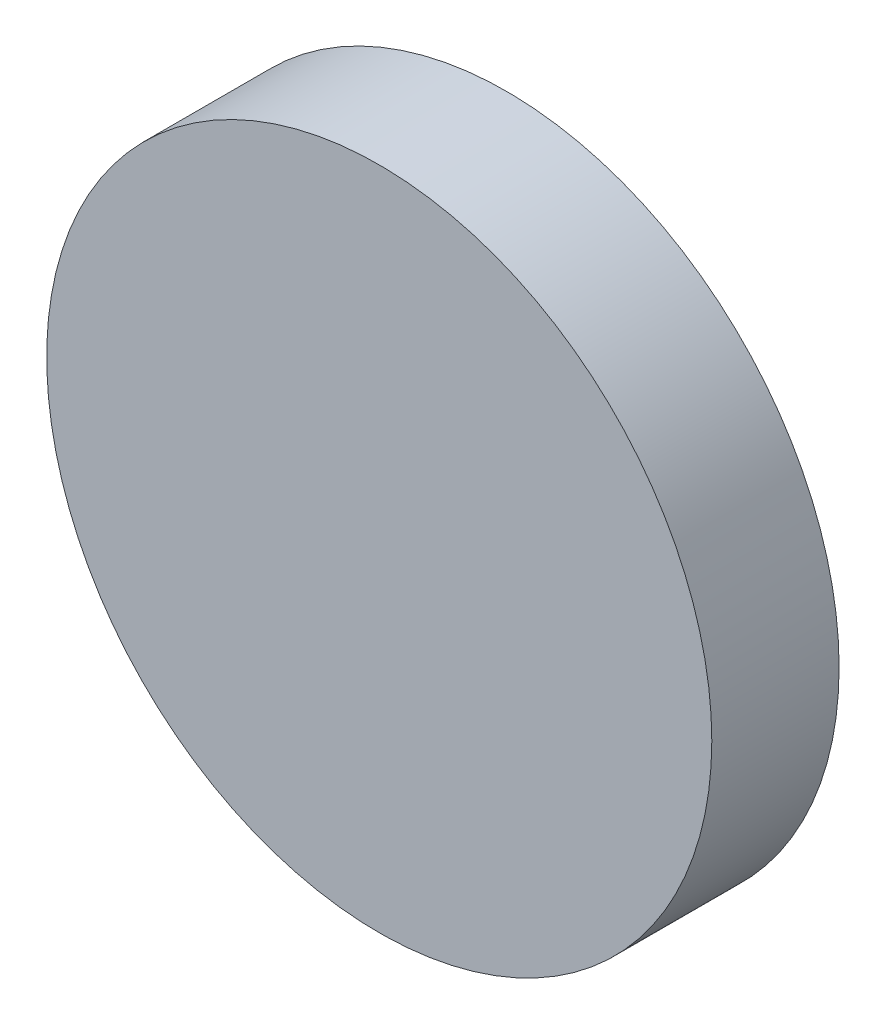
ISO-10303-21;
HEADER;
FILE_DESCRIPTION(('STEP AP214'),'2;1');
FILE_NAME('part.step','',(''),(''),'','','');
FILE_SCHEMA(('AUTOMOTIVE_DESIGN { 1 0 10303 214 1 1 1 1 }'));
ENDSEC;
DATA;
#1=APPLICATION_CONTEXT('core data for automotive mechanical design processes');
#2=APPLICATION_PROTOCOL_DEFINITION('international standard','automotive_design',2000,#1);
#3=PRODUCT_CONTEXT('',#1,'mechanical');
#4=PRODUCT('Part','Part','',(#3));
#5=PRODUCT_RELATED_PRODUCT_CATEGORY('part','',(#4));
#6=PRODUCT_DEFINITION_FORMATION('','',#4);
#7=PRODUCT_DEFINITION_CONTEXT('part definition',#1,'design');
#8=PRODUCT_DEFINITION('design','',#6,#7);
#9=PRODUCT_DEFINITION_SHAPE('','',#8);
#10=(LENGTH_UNIT() NAMED_UNIT(*) SI_UNIT(.MILLI.,.METRE.));
#11=(NAMED_UNIT(*) PLANE_ANGLE_UNIT() SI_UNIT($,.RADIAN.));
#12=(NAMED_UNIT(*) SI_UNIT($,.STERADIAN.) SOLID_ANGLE_UNIT());
#13=UNCERTAINTY_MEASURE_WITH_UNIT(LENGTH_MEASURE(1.E-05),#10,'distance_accuracy_value','');
#14=(GEOMETRIC_REPRESENTATION_CONTEXT(3) GLOBAL_UNCERTAINTY_ASSIGNED_CONTEXT((#13)) GLOBAL_UNIT_ASSIGNED_CONTEXT((#10,
#11,#12)) REPRESENTATION_CONTEXT('',''));
#15=CARTESIAN_POINT('',(0.,0.,0.));
#16=DIRECTION('',(0.,0.,1.));
#17=DIRECTION('',(1.,0.,0.));
#18=AXIS2_PLACEMENT_3D('',#15,#16,#17);
#19=CARTESIAN_POINT('',(0.,0.,49.));
#20=DIRECTION('',(0.,0.,-1.));
#21=DIRECTION('',(-1.,0.,0.));
#22=AXIS2_PLACEMENT_3D('',#19,#20,#21);
#23=CYLINDRICAL_SURFACE('',#22,128.);
#24=CARTESIAN_POINT('',(0.,0.,49.));
#25=DIRECTION('',(0.,0.,1.));
#26=DIRECTION('',(1.,0.,0.));
#27=AXIS2_PLACEMENT_3D('',#24,#25,#26);
#28=CIRCLE('',#27,128.);
#29=CARTESIAN_POINT('',(128.,0.,49.));
#30=VERTEX_POINT('',#29);
#31=EDGE_CURVE('E10',#30,#30,#28,.T.);
#32=ORIENTED_EDGE('',*,*,#31,.F.);
#33=EDGE_LOOP('',(#32));
#34=FACE_BOUND('',#33,.T.);
#35=CARTESIAN_POINT('',(0.,0.,0.));
#36=DIRECTION('',(0.,0.,1.));
#37=DIRECTION('',(1.,0.,0.));
#38=AXIS2_PLACEMENT_3D('',#35,#36,#37);
#39=CIRCLE('',#38,128.);
#40=CARTESIAN_POINT('',(128.,0.,0.));
#41=VERTEX_POINT('',#40);
#42=EDGE_CURVE('E36',#41,#41,#39,.T.);
#43=ORIENTED_EDGE('',*,*,#42,.T.);
#44=EDGE_LOOP('',(#43));
#45=FACE_BOUND('',#44,.T.);
#46=ADVANCED_FACE('F33',(#34,#45),#23,.T.);
#47=CARTESIAN_POINT('',(0.,0.,49.));
#48=DIRECTION('',(0.,0.,1.));
#49=DIRECTION('',(1.,0.,0.));
#50=AXIS2_PLACEMENT_3D('',#47,#48,#49);
#51=PLANE('',#50);
#52=ORIENTED_EDGE('',*,*,#31,.T.);
#53=EDGE_LOOP('',(#52));
#54=FACE_BOUND('',#53,.T.);
#55=ADVANCED_FACE('F48',(#54),#51,.T.);
#56=CARTESIAN_POINT('',(0.,0.,0.));
#57=DIRECTION('',(0.,0.,1.));
#58=DIRECTION('',(1.,0.,0.));
#59=AXIS2_PLACEMENT_3D('',#56,#57,#58);
#60=PLANE('',#59);
#61=ORIENTED_EDGE('',*,*,#42,.F.);
#62=EDGE_LOOP('',(#61));
#63=FACE_BOUND('',#62,.T.);
#64=ADVANCED_FACE('F46',(#63),#60,.F.);
#65=CLOSED_SHELL('',(#46,#55,#64));
#66=MANIFOLD_SOLID_BREP('B2',#65);
#67=ADVANCED_BREP_SHAPE_REPRESENTATION('',(#18,#66),#14);
#68=SHAPE_DEFINITION_REPRESENTATION(#9,#67);
ENDSEC;
END-ISO-10303-21;
